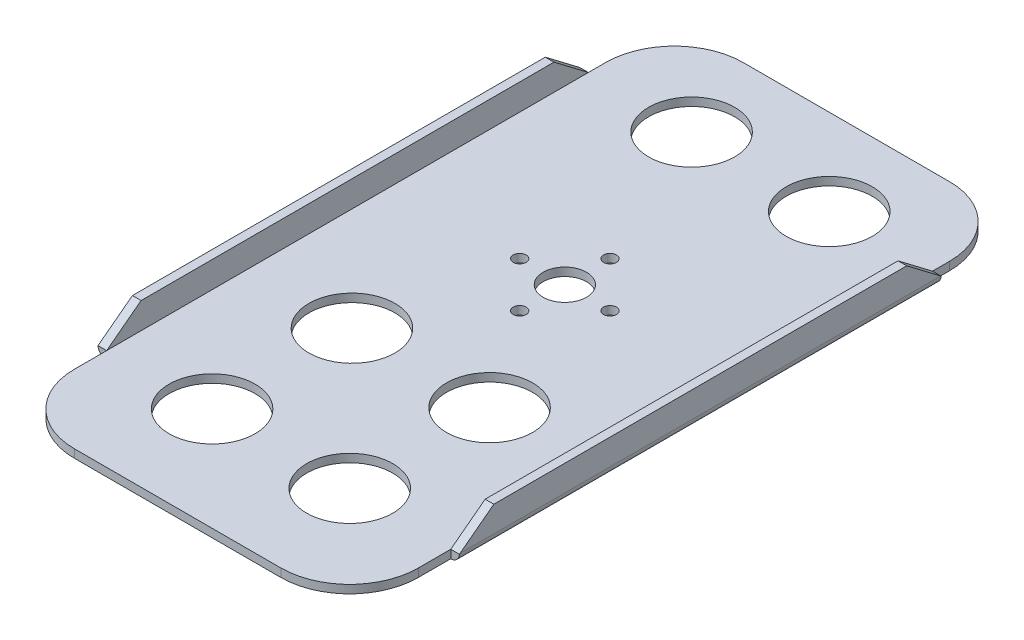
ISO-10303-21;
HEADER;
FILE_DESCRIPTION(('STEP AP214'),'2;1');
FILE_NAME('part.step','',(''),(''),'','','');
FILE_SCHEMA(('AUTOMOTIVE_DESIGN { 1 0 10303 214 1 1 1 1 }'));
ENDSEC;
DATA;
#1=APPLICATION_CONTEXT('core data for automotive mechanical design processes');
#2=APPLICATION_PROTOCOL_DEFINITION('international standard','automotive_design',2000,#1);
#3=PRODUCT_CONTEXT('',#1,'mechanical');
#4=PRODUCT('Part','Part','',(#3));
#5=PRODUCT_RELATED_PRODUCT_CATEGORY('part','',(#4));
#6=PRODUCT_DEFINITION_FORMATION('','',#4);
#7=PRODUCT_DEFINITION_CONTEXT('part definition',#1,'design');
#8=PRODUCT_DEFINITION('design','',#6,#7);
#9=PRODUCT_DEFINITION_SHAPE('','',#8);
#10=(LENGTH_UNIT() NAMED_UNIT(*) SI_UNIT(.MILLI.,.METRE.));
#11=(NAMED_UNIT(*) PLANE_ANGLE_UNIT() SI_UNIT($,.RADIAN.));
#12=(NAMED_UNIT(*) SI_UNIT($,.STERADIAN.) SOLID_ANGLE_UNIT());
#13=UNCERTAINTY_MEASURE_WITH_UNIT(LENGTH_MEASURE(1.E-05),#10,'distance_accuracy_value','');
#14=(GEOMETRIC_REPRESENTATION_CONTEXT(3) GLOBAL_UNCERTAINTY_ASSIGNED_CONTEXT((#13)) GLOBAL_UNIT_ASSIGNED_CONTEXT((#10,
#11,#12)) REPRESENTATION_CONTEXT('',''));
#15=CARTESIAN_POINT('',(0.,0.,0.));
#16=DIRECTION('',(0.,0.,1.));
#17=DIRECTION('',(1.,0.,0.));
#18=AXIS2_PLACEMENT_3D('',#15,#16,#17);
#19=CARTESIAN_POINT('',(33.3502,6.35,9.75360000000003));
#20=DIRECTION('',(1.,0.,0.));
#21=DIRECTION('',(0.,0.,-1.));
#22=AXIS2_PLACEMENT_3D('',#19,#20,#21);
#23=PLANE('',#22);
#24=DIRECTION('',(0.,0.605083267533558,-0.796162194123103));
#25=VECTOR('',#24,1.);
#26=CARTESIAN_POINT('',(33.3502,1.524,52.8066));
#27=LINE('',#26,#25);
#28=CARTESIAN_POINT('',(33.3502,1.5875,52.7230473684211));
#29=VERTEX_POINT('',#28);
#30=CARTESIAN_POINT('',(33.3502,6.35,46.4566));
#31=VERTEX_POINT('',#30);
#32=EDGE_CURVE('E398',#29,#31,#27,.T.);
#33=ORIENTED_EDGE('',*,*,#32,.F.);
#34=DIRECTION('',(0.,0.,1.));
#35=VECTOR('',#34,1.);
#36=CARTESIAN_POINT('',(33.3502,1.5875,-36.0934));
#37=LINE('',#36,#35);
#38=CARTESIAN_POINT('',(33.3502,1.5875,-36.009847368421));
#39=VERTEX_POINT('',#38);
#40=EDGE_CURVE('E49',#29,#39,#37,.F.);
#41=ORIENTED_EDGE('',*,*,#40,.T.);
#42=DIRECTION('',(0.,-0.605083267533558,-0.796162194123103));
#43=VECTOR('',#42,1.);
#44=CARTESIAN_POINT('',(33.3502,1.524,-36.0934));
#45=LINE('',#44,#43);
#46=CARTESIAN_POINT('',(33.3502,6.35,-29.7434));
#47=VERTEX_POINT('',#46);
#48=EDGE_CURVE('E188',#47,#39,#45,.T.);
#49=ORIENTED_EDGE('',*,*,#48,.F.);
#50=DIRECTION('',(0.,0.,1.));
#51=VECTOR('',#50,1.);
#52=CARTESIAN_POINT('',(33.3502,6.35,9.75360000000003));
#53=LINE('',#52,#51);
#54=EDGE_CURVE('E223',#47,#31,#53,.T.);
#55=ORIENTED_EDGE('',*,*,#54,.T.);
#56=EDGE_LOOP('',(#33,#41,#49,#55));
#57=FACE_BOUND('',#56,.T.);
#58=ADVANCED_FACE('F27',(#57),#23,.T.);
#59=CARTESIAN_POINT('',(31.75,6.35,9.75360000000001));
#60=DIRECTION('',(1.,0.,0.));
#61=DIRECTION('',(0.,0.,-1.));
#62=AXIS2_PLACEMENT_3D('',#59,#60,#61);
#63=PLANE('',#62);
#64=DIRECTION('',(0.,0.605083267533558,0.796162194123103));
#65=VECTOR('',#64,1.);
#66=CARTESIAN_POINT('',(31.75,25.3774594320487,-4.70726916835698));
#67=LINE('',#66,#65);
#68=CARTESIAN_POINT('',(31.75,1.524,-36.0934));
#69=VERTEX_POINT('',#68);
#70=CARTESIAN_POINT('',(31.75,6.35,-29.7434));
#71=VERTEX_POINT('',#70);
#72=EDGE_CURVE('E435',#69,#71,#67,.T.);
#73=ORIENTED_EDGE('',*,*,#72,.F.);
#74=DIRECTION('',(0.,0.,-1.));
#75=VECTOR('',#74,1.);
#76=CARTESIAN_POINT('',(31.75,1.524,9.75360000000001));
#77=LINE('',#76,#75);
#78=CARTESIAN_POINT('',(31.75,1.524,52.8066));
#79=VERTEX_POINT('',#78);
#80=EDGE_CURVE('E234',#79,#69,#77,.T.);
#81=ORIENTED_EDGE('',*,*,#80,.F.);
#82=DIRECTION('',(0.,-0.605083267533558,0.796162194123103));
#83=VECTOR('',#82,1.);
#84=CARTESIAN_POINT('',(31.75,24.0314655172414,23.1915137931034));
#85=LINE('',#84,#83);
#86=CARTESIAN_POINT('',(31.75,6.35,46.4566));
#87=VERTEX_POINT('',#86);
#88=EDGE_CURVE('E434',#87,#79,#85,.T.);
#89=ORIENTED_EDGE('',*,*,#88,.F.);
#90=DIRECTION('',(0.,0.,1.));
#91=VECTOR('',#90,1.);
#92=CARTESIAN_POINT('',(31.75,6.35,9.75360000000001));
#93=LINE('',#92,#91);
#94=EDGE_CURVE('E226',#71,#87,#93,.T.);
#95=ORIENTED_EDGE('',*,*,#94,.F.);
#96=EDGE_LOOP('',(#73,#81,#89,#95));
#97=FACE_BOUND('',#96,.T.);
#98=ADVANCED_FACE('F432',(#97),#63,.F.);
#99=CARTESIAN_POINT('',(-109.278287355664,6.35,9.75360000000003));
#100=DIRECTION('',(0.,1.,0.));
#101=DIRECTION('',(0.,0.,1.));
#102=AXIS2_PLACEMENT_3D('',#99,#100,#101);
#103=PLANE('',#102);
#104=ORIENTED_EDGE('',*,*,#54,.F.);
#105=DIRECTION('',(-1.,0.,0.));
#106=VECTOR('',#105,1.);
#107=CARTESIAN_POINT('',(33.3502,6.35,-29.7434));
#108=LINE('',#107,#106);
#109=EDGE_CURVE('E198',#47,#71,#108,.T.);
#110=ORIENTED_EDGE('',*,*,#109,.T.);
#111=ORIENTED_EDGE('',*,*,#94,.T.);
#112=DIRECTION('',(-1.,0.,0.));
#113=VECTOR('',#112,1.);
#114=CARTESIAN_POINT('',(33.3502,6.35,46.4566));
#115=LINE('',#114,#113);
#116=EDGE_CURVE('E404',#31,#87,#115,.T.);
#117=ORIENTED_EDGE('',*,*,#116,.F.);
#118=EDGE_LOOP('',(#104,#110,#111,#117));
#119=FACE_BOUND('',#118,.T.);
#120=ADVANCED_FACE('F510',(#119),#103,.T.);
#121=CARTESIAN_POINT('',(-31.75,6.35,9.75360000000005));
#122=DIRECTION('',(1.,0.,0.));
#123=DIRECTION('',(0.,0.,-1.));
#124=AXIS2_PLACEMENT_3D('',#121,#122,#123);
#125=PLANE('',#124);
#126=DIRECTION('',(0.,0.,-1.));
#127=VECTOR('',#126,1.);
#128=CARTESIAN_POINT('',(-31.75,1.524,9.75360000000005));
#129=LINE('',#128,#127);
#130=CARTESIAN_POINT('',(-31.75,1.524,52.8066));
#131=VERTEX_POINT('',#130);
#132=CARTESIAN_POINT('',(-31.75,1.524,-36.0934));
#133=VERTEX_POINT('',#132);
#134=EDGE_CURVE('E215',#131,#133,#129,.T.);
#135=ORIENTED_EDGE('',*,*,#134,.T.);
#136=DIRECTION('',(0.,0.605083267533558,0.796162194123103));
#137=VECTOR('',#136,1.);
#138=CARTESIAN_POINT('',(-31.75,25.3774594320487,-4.70726916835695));
#139=LINE('',#138,#137);
#140=CARTESIAN_POINT('',(-31.75,6.35,-29.7434));
#141=VERTEX_POINT('',#140);
#142=EDGE_CURVE('E462',#133,#141,#139,.T.);
#143=ORIENTED_EDGE('',*,*,#142,.T.);
#144=DIRECTION('',(0.,0.,1.));
#145=VECTOR('',#144,1.);
#146=CARTESIAN_POINT('',(-31.75,6.35,9.75360000000005));
#147=LINE('',#146,#145);
#148=CARTESIAN_POINT('',(-31.75,6.35,46.4566));
#149=VERTEX_POINT('',#148);
#150=EDGE_CURVE('E197',#141,#149,#147,.T.);
#151=ORIENTED_EDGE('',*,*,#150,.T.);
#152=DIRECTION('',(0.,-0.605083267533558,0.796162194123103));
#153=VECTOR('',#152,1.);
#154=CARTESIAN_POINT('',(-31.75,24.0314655172414,23.1915137931035));
#155=LINE('',#154,#153);
#156=EDGE_CURVE('E442',#149,#131,#155,.T.);
#157=ORIENTED_EDGE('',*,*,#156,.T.);
#158=EDGE_LOOP('',(#135,#143,#151,#157));
#159=FACE_BOUND('',#158,.T.);
#160=ADVANCED_FACE('F473',(#159),#125,.T.);
#161=CARTESIAN_POINT('',(-33.3502,6.35,9.75360000000003));
#162=DIRECTION('',(1.,0.,0.));
#163=DIRECTION('',(0.,0.,-1.));
#164=AXIS2_PLACEMENT_3D('',#161,#162,#163);
#165=PLANE('',#164);
#166=DIRECTION('',(0.,-0.605083267533558,-0.796162194123103));
#167=VECTOR('',#166,1.);
#168=CARTESIAN_POINT('',(-33.3502,1.524,-36.0934));
#169=LINE('',#168,#167);
#170=CARTESIAN_POINT('',(-33.3502,6.35,-29.7434));
#171=VERTEX_POINT('',#170);
#172=CARTESIAN_POINT('',(-33.3502,1.5875,-36.009847368421));
#173=VERTEX_POINT('',#172);
#174=EDGE_CURVE('E175',#171,#173,#169,.T.);
#175=ORIENTED_EDGE('',*,*,#174,.T.);
#176=DIRECTION('',(0.,0.,1.));
#177=VECTOR('',#176,1.);
#178=CARTESIAN_POINT('',(-33.3502,1.5875,9.75360000000003));
#179=LINE('',#178,#177);
#180=CARTESIAN_POINT('',(-33.3502,1.5875,52.7230473684211));
#181=VERTEX_POINT('',#180);
#182=EDGE_CURVE('E375',#173,#181,#179,.T.);
#183=ORIENTED_EDGE('',*,*,#182,.T.);
#184=DIRECTION('',(0.,0.605083267533558,-0.796162194123103));
#185=VECTOR('',#184,1.);
#186=CARTESIAN_POINT('',(-33.3502,1.524,52.8066));
#187=LINE('',#186,#185);
#188=CARTESIAN_POINT('',(-33.3502,6.35,46.4566));
#189=VERTEX_POINT('',#188);
#190=EDGE_CURVE('E203',#181,#189,#187,.T.);
#191=ORIENTED_EDGE('',*,*,#190,.T.);
#192=DIRECTION('',(0.,0.,1.));
#193=VECTOR('',#192,1.);
#194=CARTESIAN_POINT('',(-33.3502,6.35,9.75360000000003));
#195=LINE('',#194,#193);
#196=EDGE_CURVE('E195',#171,#189,#195,.T.);
#197=ORIENTED_EDGE('',*,*,#196,.F.);
#198=EDGE_LOOP('',(#175,#183,#191,#197));
#199=FACE_BOUND('',#198,.T.);
#200=ADVANCED_FACE('F201',(#199),#165,.F.);
#201=CARTESIAN_POINT('',(-109.278287355664,6.35,9.75360000000003));
#202=DIRECTION('',(0.,1.,0.));
#203=DIRECTION('',(0.,0.,1.));
#204=AXIS2_PLACEMENT_3D('',#201,#202,#203);
#205=PLANE('',#204);
#206=ORIENTED_EDGE('',*,*,#150,.F.);
#207=EDGE_CURVE('E180',#141,#171,#108,.T.);
#208=ORIENTED_EDGE('',*,*,#207,.T.);
#209=ORIENTED_EDGE('',*,*,#196,.T.);
#210=DIRECTION('',(1.,0.,0.));
#211=VECTOR('',#210,1.);
#212=CARTESIAN_POINT('',(-109.278287355664,6.35,46.4566));
#213=LINE('',#212,#211);
#214=EDGE_CURVE('E371',#189,#149,#213,.T.);
#215=ORIENTED_EDGE('',*,*,#214,.T.);
#216=EDGE_LOOP('',(#206,#208,#209,#215));
#217=FACE_BOUND('',#216,.T.);
#218=ADVANCED_FACE('F193',(#217),#205,.T.);
#219=CARTESIAN_POINT('',(-109.278287355664,6.35,-36.0934));
#220=DIRECTION('',(0.,0.,1.));
#221=DIRECTION('',(1.,0.,0.));
#222=AXIS2_PLACEMENT_3D('',#219,#220,#221);
#223=PLANE('',#222);
#224=DIRECTION('',(-1.,0.,0.));
#225=VECTOR('',#224,1.);
#226=CARTESIAN_POINT('',(33.3502,1.524,-36.0934));
#227=LINE('',#226,#225);
#228=CARTESIAN_POINT('',(33.3489294915932,1.524,-36.0934));
#229=VERTEX_POINT('',#228);
#230=EDGE_CURVE('E199',#229,#69,#227,.T.);
#231=ORIENTED_EDGE('',*,*,#230,.F.);
#232=CARTESIAN_POINT('',(31.7627,1.5875,-36.0934));
#233=DIRECTION('',(0.,0.,1.));
#234=DIRECTION('',(1.,0.,0.));
#235=AXIS2_PLACEMENT_3D('',#232,#233,#234);
#236=CIRCLE('',#235,1.5875);
#237=CARTESIAN_POINT('',(31.7627,0.,-36.0934));
#238=VERTEX_POINT('',#237);
#239=EDGE_CURVE('E11',#229,#238,#236,.F.);
#240=ORIENTED_EDGE('',*,*,#239,.T.);
#241=DIRECTION('',(-1.,0.,0.));
#242=VECTOR('',#241,1.);
#243=CARTESIAN_POINT('',(-109.278287355664,0.,-36.0934));
#244=LINE('',#243,#242);
#245=CARTESIAN_POINT('',(31.75,0.,-36.0934));
#246=VERTEX_POINT('',#245);
#247=EDGE_CURVE('E218',#238,#246,#244,.T.);
#248=ORIENTED_EDGE('',*,*,#247,.T.);
#249=DIRECTION('',(0.,-1.,0.));
#250=VECTOR('',#249,1.);
#251=CARTESIAN_POINT('',(31.75,6.35,-36.0934));
#252=LINE('',#251,#250);
#253=EDGE_CURVE('E231',#69,#246,#252,.T.);
#254=ORIENTED_EDGE('',*,*,#253,.F.);
#255=EDGE_LOOP('',(#231,#240,#248,#254));
#256=FACE_BOUND('',#255,.T.);
#257=ADVANCED_FACE('F411',(#256),#223,.F.);
#258=CARTESIAN_POINT('',(-109.278287355664,6.35,-36.0934));
#259=DIRECTION('',(0.,0.,-1.));
#260=DIRECTION('',(-1.,0.,0.));
#261=AXIS2_PLACEMENT_3D('',#258,#259,#260);
#262=PLANE('',#261);
#263=DIRECTION('',(1.,0.,0.));
#264=VECTOR('',#263,1.);
#265=CARTESIAN_POINT('',(-109.278287355664,0.,-36.0934));
#266=LINE('',#265,#264);
#267=CARTESIAN_POINT('',(-31.7627,0.,-36.0934));
#268=VERTEX_POINT('',#267);
#269=CARTESIAN_POINT('',(-31.75,0.,-36.0934));
#270=VERTEX_POINT('',#269);
#271=EDGE_CURVE('E445',#268,#270,#266,.T.);
#272=ORIENTED_EDGE('',*,*,#271,.F.);
#273=CARTESIAN_POINT('',(-31.7627,1.5875,-36.0934));
#274=DIRECTION('',(0.,0.,-1.));
#275=DIRECTION('',(-1.,0.,0.));
#276=AXIS2_PLACEMENT_3D('',#273,#274,#275);
#277=CIRCLE('',#276,1.5875);
#278=CARTESIAN_POINT('',(-33.3489294915932,1.524,-36.0934));
#279=VERTEX_POINT('',#278);
#280=EDGE_CURVE('E386',#268,#279,#277,.T.);
#281=ORIENTED_EDGE('',*,*,#280,.T.);
#282=DIRECTION('',(1.,0.,0.));
#283=VECTOR('',#282,1.);
#284=CARTESIAN_POINT('',(-109.278287355664,1.524,-36.0934));
#285=LINE('',#284,#283);
#286=EDGE_CURVE('E373',#279,#133,#285,.T.);
#287=ORIENTED_EDGE('',*,*,#286,.T.);
#288=DIRECTION('',(0.,-1.,0.));
#289=VECTOR('',#288,1.);
#290=CARTESIAN_POINT('',(-31.75,6.35,-36.0934));
#291=LINE('',#290,#289);
#292=EDGE_CURVE('E207',#133,#270,#291,.T.);
#293=ORIENTED_EDGE('',*,*,#292,.T.);
#294=EDGE_LOOP('',(#272,#281,#287,#293));
#295=FACE_BOUND('',#294,.T.);
#296=ADVANCED_FACE('F461',(#295),#262,.T.);
#297=CARTESIAN_POINT('',(-109.278287355664,6.35,52.8066));
#298=DIRECTION('',(0.,0.,-1.));
#299=DIRECTION('',(-1.,0.,0.));
#300=AXIS2_PLACEMENT_3D('',#297,#298,#299);
#301=PLANE('',#300);
#302=DIRECTION('',(1.,0.,0.));
#303=VECTOR('',#302,1.);
#304=CARTESIAN_POINT('',(-109.278287355664,0.,52.8066));
#305=LINE('',#304,#303);
#306=CARTESIAN_POINT('',(31.75,0.,52.8066));
#307=VERTEX_POINT('',#306);
#308=CARTESIAN_POINT('',(31.7627,0.,52.8066));
#309=VERTEX_POINT('',#308);
#310=EDGE_CURVE('E220',#307,#309,#305,.T.);
#311=ORIENTED_EDGE('',*,*,#310,.T.);
#312=CARTESIAN_POINT('',(31.7627,1.5875,52.8066));
#313=DIRECTION('',(0.,0.,-1.));
#314=DIRECTION('',(-1.,0.,0.));
#315=AXIS2_PLACEMENT_3D('',#312,#313,#314);
#316=CIRCLE('',#315,1.5875);
#317=CARTESIAN_POINT('',(33.3489294915932,1.524,52.8066));
#318=VERTEX_POINT('',#317);
#319=EDGE_CURVE('E389',#309,#318,#316,.F.);
#320=ORIENTED_EDGE('',*,*,#319,.T.);
#321=DIRECTION('',(-1.,0.,0.));
#322=VECTOR('',#321,1.);
#323=CARTESIAN_POINT('',(33.3502,1.524,52.8066));
#324=LINE('',#323,#322);
#325=EDGE_CURVE('E400',#318,#79,#324,.T.);
#326=ORIENTED_EDGE('',*,*,#325,.T.);
#327=DIRECTION('',(0.,-1.,0.));
#328=VECTOR('',#327,1.);
#329=CARTESIAN_POINT('',(31.75,6.35,52.8066));
#330=LINE('',#329,#328);
#331=EDGE_CURVE('E228',#79,#307,#330,.T.);
#332=ORIENTED_EDGE('',*,*,#331,.T.);
#333=EDGE_LOOP('',(#311,#320,#326,#332));
#334=FACE_BOUND('',#333,.T.);
#335=ADVANCED_FACE('F441',(#334),#301,.F.);
#336=CARTESIAN_POINT('',(-109.278287355664,6.35,52.8066));
#337=DIRECTION('',(0.,0.,1.));
#338=DIRECTION('',(1.,0.,0.));
#339=AXIS2_PLACEMENT_3D('',#336,#337,#338);
#340=PLANE('',#339);
#341=CARTESIAN_POINT('',(-33.3489294915932,1.524,52.8066));
#342=VERTEX_POINT('',#341);
#343=EDGE_CURVE('E443',#131,#342,#324,.T.);
#344=ORIENTED_EDGE('',*,*,#343,.T.);
#345=CARTESIAN_POINT('',(-31.7627,1.5875,52.8066));
#346=DIRECTION('',(0.,0.,1.));
#347=DIRECTION('',(1.,0.,0.));
#348=AXIS2_PLACEMENT_3D('',#345,#346,#347);
#349=CIRCLE('',#348,1.5875);
#350=CARTESIAN_POINT('',(-31.7627,0.,52.8066));
#351=VERTEX_POINT('',#350);
#352=EDGE_CURVE('E379',#342,#351,#349,.T.);
#353=ORIENTED_EDGE('',*,*,#352,.T.);
#354=DIRECTION('',(-1.,0.,0.));
#355=VECTOR('',#354,1.);
#356=CARTESIAN_POINT('',(-109.278287355664,0.,52.8066));
#357=LINE('',#356,#355);
#358=CARTESIAN_POINT('',(-31.75,0.,52.8066));
#359=VERTEX_POINT('',#358);
#360=EDGE_CURVE('E209',#359,#351,#357,.T.);
#361=ORIENTED_EDGE('',*,*,#360,.F.);
#362=DIRECTION('',(0.,-1.,0.));
#363=VECTOR('',#362,1.);
#364=CARTESIAN_POINT('',(-31.75,6.35,52.8066));
#365=LINE('',#364,#363);
#366=EDGE_CURVE('E204',#131,#359,#365,.T.);
#367=ORIENTED_EDGE('',*,*,#366,.F.);
#368=EDGE_LOOP('',(#344,#353,#361,#367));
#369=FACE_BOUND('',#368,.T.);
#370=ADVANCED_FACE('F532',(#369),#340,.T.);
#371=CARTESIAN_POINT('',(-31.75,1.524,9.75360000000005));
#372=DIRECTION('',(1.,0.,0.));
#373=DIRECTION('',(0.,0.,-1.));
#374=AXIS2_PLACEMENT_3D('',#371,#372,#373);
#375=PLANE('',#374);
#376=DIRECTION('',(0.,0.,1.));
#377=VECTOR('',#376,1.);
#378=CARTESIAN_POINT('',(-31.75,0.,9.75360000000005));
#379=LINE('',#378,#377);
#380=CARTESIAN_POINT('',(-31.75,0.,-39.2684));
#381=VERTEX_POINT('',#380);
#382=EDGE_CURVE('E271',#381,#270,#379,.T.);
#383=ORIENTED_EDGE('',*,*,#382,.T.);
#384=ORIENTED_EDGE('',*,*,#292,.F.);
#385=DIRECTION('',(0.,0.,1.));
#386=VECTOR('',#385,1.);
#387=CARTESIAN_POINT('',(-31.75,1.524,9.75360000000005));
#388=LINE('',#387,#386);
#389=CARTESIAN_POINT('',(-31.75,1.524,-39.2684));
#390=VERTEX_POINT('',#389);
#391=EDGE_CURVE('E330',#390,#133,#388,.T.);
#392=ORIENTED_EDGE('',*,*,#391,.F.);
#393=DIRECTION('',(0.,-1.,0.));
#394=VECTOR('',#393,1.);
#395=CARTESIAN_POINT('',(-31.75,1.524,-39.2684));
#396=LINE('',#395,#394);
#397=EDGE_CURVE('E353',#390,#381,#396,.T.);
#398=ORIENTED_EDGE('',*,*,#397,.T.);
#399=EDGE_LOOP('',(#383,#384,#392,#398));
#400=FACE_BOUND('',#399,.T.);
#401=ADVANCED_FACE('F468',(#400),#375,.F.);
#402=CARTESIAN_POINT('',(31.75,1.524,9.75359999999999));
#403=DIRECTION('',(1.,0.,0.));
#404=DIRECTION('',(0.,0.,-1.));
#405=AXIS2_PLACEMENT_3D('',#402,#403,#404);
#406=PLANE('',#405);
#407=DIRECTION('',(0.,0.,1.));
#408=VECTOR('',#407,1.);
#409=CARTESIAN_POINT('',(31.75,1.524,9.75359999999999));
#410=LINE('',#409,#408);
#411=CARTESIAN_POINT('',(31.75,1.524,-39.2684));
#412=VERTEX_POINT('',#411);
#413=EDGE_CURVE('E342',#412,#69,#410,.T.);
#414=ORIENTED_EDGE('',*,*,#413,.T.);
#415=ORIENTED_EDGE('',*,*,#253,.T.);
#416=DIRECTION('',(0.,0.,1.));
#417=VECTOR('',#416,1.);
#418=CARTESIAN_POINT('',(31.75,0.,9.75359999999999));
#419=LINE('',#418,#417);
#420=CARTESIAN_POINT('',(31.75,0.,-39.2684));
#421=VERTEX_POINT('',#420);
#422=EDGE_CURVE('E284',#421,#246,#419,.T.);
#423=ORIENTED_EDGE('',*,*,#422,.F.);
#424=DIRECTION('',(0.,-1.,0.));
#425=VECTOR('',#424,1.);
#426=CARTESIAN_POINT('',(31.75,1.524,-39.2684));
#427=LINE('',#426,#425);
#428=EDGE_CURVE('E359',#412,#421,#427,.T.);
#429=ORIENTED_EDGE('',*,*,#428,.F.);
#430=EDGE_LOOP('',(#414,#415,#423,#429));
#431=FACE_BOUND('',#430,.T.);
#432=ADVANCED_FACE('F419',(#431),#406,.T.);
#433=CARTESIAN_POINT('',(31.75,0.,58.7756));
#434=VERTEX_POINT('',#433);
#435=EDGE_CURVE('E283',#307,#434,#419,.T.);
#436=ORIENTED_EDGE('',*,*,#435,.F.);
#437=ORIENTED_EDGE('',*,*,#331,.F.);
#438=CARTESIAN_POINT('',(31.75,1.524,58.7756));
#439=VERTEX_POINT('',#438);
#440=EDGE_CURVE('E341',#79,#439,#410,.T.);
#441=ORIENTED_EDGE('',*,*,#440,.T.);
#442=DIRECTION('',(0.,-1.,0.));
#443=VECTOR('',#442,1.);
#444=CARTESIAN_POINT('',(31.75,1.524,58.7756));
#445=LINE('',#444,#443);
#446=EDGE_CURVE('E361',#439,#434,#445,.T.);
#447=ORIENTED_EDGE('',*,*,#446,.T.);
#448=EDGE_LOOP('',(#436,#437,#441,#447));
#449=FACE_BOUND('',#448,.T.);
#450=ADVANCED_FACE('F438',(#449),#406,.T.);
#451=CARTESIAN_POINT('',(-31.75,1.524,58.7756));
#452=VERTEX_POINT('',#451);
#453=EDGE_CURVE('E329',#131,#452,#388,.T.);
#454=ORIENTED_EDGE('',*,*,#453,.F.);
#455=ORIENTED_EDGE('',*,*,#366,.T.);
#456=CARTESIAN_POINT('',(-31.75,0.,58.7756));
#457=VERTEX_POINT('',#456);
#458=EDGE_CURVE('E270',#359,#457,#379,.T.);
#459=ORIENTED_EDGE('',*,*,#458,.T.);
#460=DIRECTION('',(0.,-1.,0.));
#461=VECTOR('',#460,1.);
#462=CARTESIAN_POINT('',(-31.75,1.524,58.7756));
#463=LINE('',#462,#461);
#464=EDGE_CURVE('E368',#452,#457,#463,.T.);
#465=ORIENTED_EDGE('',*,*,#464,.F.);
#466=EDGE_LOOP('',(#454,#455,#459,#465));
#467=FACE_BOUND('',#466,.T.);
#468=ADVANCED_FACE('F479',(#467),#375,.F.);
#469=CARTESIAN_POINT('',(-19.05,1.524,58.7756));
#470=DIRECTION('',(0.,-1.,0.));
#471=DIRECTION('',(0.,0.,-1.));
#472=AXIS2_PLACEMENT_3D('',#469,#470,#471);
#473=CYLINDRICAL_SURFACE('',#472,12.7);
#474=CARTESIAN_POINT('',(-19.05,0.,58.7756));
#475=DIRECTION('',(0.,1.,0.));
#476=DIRECTION('',(0.,0.,1.));
#477=AXIS2_PLACEMENT_3D('',#474,#475,#476);
#478=CIRCLE('',#477,12.7);
#479=CARTESIAN_POINT('',(-19.05,0.,71.4756));
#480=VERTEX_POINT('',#479);
#481=EDGE_CURVE('E274',#457,#480,#478,.T.);
#482=ORIENTED_EDGE('',*,*,#481,.T.);
#483=DIRECTION('',(0.,-1.,0.));
#484=VECTOR('',#483,1.);
#485=CARTESIAN_POINT('',(-19.05,1.524,71.4756));
#486=LINE('',#485,#484);
#487=CARTESIAN_POINT('',(-19.05,1.524,71.4756));
#488=VERTEX_POINT('',#487);
#489=EDGE_CURVE('E366',#488,#480,#486,.T.);
#490=ORIENTED_EDGE('',*,*,#489,.F.);
#491=CARTESIAN_POINT('',(-19.05,1.524,58.7756));
#492=DIRECTION('',(0.,1.,0.));
#493=DIRECTION('',(0.,0.,1.));
#494=AXIS2_PLACEMENT_3D('',#491,#492,#493);
#495=CIRCLE('',#494,12.7);
#496=EDGE_CURVE('E333',#452,#488,#495,.T.);
#497=ORIENTED_EDGE('',*,*,#496,.F.);
#498=ORIENTED_EDGE('',*,*,#464,.T.);
#499=EDGE_LOOP('',(#482,#490,#497,#498));
#500=FACE_BOUND('',#499,.T.);
#501=ADVANCED_FACE('F484',(#500),#473,.T.);
#502=CARTESIAN_POINT('',(-109.278287355664,1.524,71.4756));
#503=DIRECTION('',(0.,0.,1.));
#504=DIRECTION('',(1.,0.,0.));
#505=AXIS2_PLACEMENT_3D('',#502,#503,#504);
#506=PLANE('',#505);
#507=DIRECTION('',(-1.,0.,0.));
#508=VECTOR('',#507,1.);
#509=CARTESIAN_POINT('',(-109.278287355664,0.,71.4756));
#510=LINE('',#509,#508);
#511=CARTESIAN_POINT('',(19.05,0.,71.4756));
#512=VERTEX_POINT('',#511);
#513=EDGE_CURVE('E277',#512,#480,#510,.T.);
#514=ORIENTED_EDGE('',*,*,#513,.F.);
#515=DIRECTION('',(0.,-1.,0.));
#516=VECTOR('',#515,1.);
#517=CARTESIAN_POINT('',(19.05,1.524,71.4756));
#518=LINE('',#517,#516);
#519=CARTESIAN_POINT('',(19.05,1.524,71.4756));
#520=VERTEX_POINT('',#519);
#521=EDGE_CURVE('E364',#520,#512,#518,.T.);
#522=ORIENTED_EDGE('',*,*,#521,.F.);
#523=DIRECTION('',(-1.,0.,0.));
#524=VECTOR('',#523,1.);
#525=CARTESIAN_POINT('',(-109.278287355664,1.524,71.4756));
#526=LINE('',#525,#524);
#527=EDGE_CURVE('E335',#520,#488,#526,.T.);
#528=ORIENTED_EDGE('',*,*,#527,.T.);
#529=ORIENTED_EDGE('',*,*,#489,.T.);
#530=EDGE_LOOP('',(#514,#522,#528,#529));
#531=FACE_BOUND('',#530,.T.);
#532=ADVANCED_FACE('F487',(#531),#506,.T.);
#533=CARTESIAN_POINT('',(19.05,1.524,58.7756));
#534=DIRECTION('',(0.,-1.,0.));
#535=DIRECTION('',(0.,0.,-1.));
#536=AXIS2_PLACEMENT_3D('',#533,#534,#535);
#537=CYLINDRICAL_SURFACE('',#536,12.7);
#538=CARTESIAN_POINT('',(19.05,0.,58.7756));
#539=DIRECTION('',(0.,1.,0.));
#540=DIRECTION('',(0.,0.,1.));
#541=AXIS2_PLACEMENT_3D('',#538,#539,#540);
#542=CIRCLE('',#541,12.7);
#543=EDGE_CURVE('E280',#434,#512,#542,.F.);
#544=ORIENTED_EDGE('',*,*,#543,.F.);
#545=ORIENTED_EDGE('',*,*,#446,.F.);
#546=CARTESIAN_POINT('',(19.05,1.524,58.7756));
#547=DIRECTION('',(0.,1.,0.));
#548=DIRECTION('',(0.,0.,1.));
#549=AXIS2_PLACEMENT_3D('',#546,#547,#548);
#550=CIRCLE('',#549,12.7);
#551=EDGE_CURVE('E338',#439,#520,#550,.F.);
#552=ORIENTED_EDGE('',*,*,#551,.T.);
#553=ORIENTED_EDGE('',*,*,#521,.T.);
#554=EDGE_LOOP('',(#544,#545,#552,#553));
#555=FACE_BOUND('',#554,.T.);
#556=ADVANCED_FACE('F490',(#555),#537,.T.);
#557=CARTESIAN_POINT('',(19.05,1.524,-39.2684));
#558=DIRECTION('',(0.,-1.,0.));
#559=DIRECTION('',(0.,0.,-1.));
#560=AXIS2_PLACEMENT_3D('',#557,#558,#559);
#561=CYLINDRICAL_SURFACE('',#560,12.7);
#562=CARTESIAN_POINT('',(19.05,0.,-39.2684));
#563=DIRECTION('',(0.,1.,0.));
#564=DIRECTION('',(0.,0.,1.));
#565=AXIS2_PLACEMENT_3D('',#562,#563,#564);
#566=CIRCLE('',#565,12.7);
#567=CARTESIAN_POINT('',(19.05,0.,-51.9684));
#568=VERTEX_POINT('',#567);
#569=EDGE_CURVE('E287',#421,#568,#566,.T.);
#570=ORIENTED_EDGE('',*,*,#569,.T.);
#571=DIRECTION('',(0.,-1.,0.));
#572=VECTOR('',#571,1.);
#573=CARTESIAN_POINT('',(19.05,1.524,-51.9684));
#574=LINE('',#573,#572);
#575=CARTESIAN_POINT('',(19.05,1.524,-51.9684));
#576=VERTEX_POINT('',#575);
#577=EDGE_CURVE('E357',#576,#568,#574,.T.);
#578=ORIENTED_EDGE('',*,*,#577,.F.);
#579=CARTESIAN_POINT('',(19.05,1.524,-39.2684));
#580=DIRECTION('',(0.,1.,0.));
#581=DIRECTION('',(0.,0.,1.));
#582=AXIS2_PLACEMENT_3D('',#579,#580,#581);
#583=CIRCLE('',#582,12.7);
#584=EDGE_CURVE('E345',#412,#576,#583,.T.);
#585=ORIENTED_EDGE('',*,*,#584,.F.);
#586=ORIENTED_EDGE('',*,*,#428,.T.);
#587=EDGE_LOOP('',(#570,#578,#585,#586));
#588=FACE_BOUND('',#587,.T.);
#589=ADVANCED_FACE('F492',(#588),#561,.T.);
#590=CARTESIAN_POINT('',(-109.278287355664,1.524,-51.9684));
#591=DIRECTION('',(0.,0.,-1.));
#592=DIRECTION('',(-1.,0.,0.));
#593=AXIS2_PLACEMENT_3D('',#590,#591,#592);
#594=PLANE('',#593);
#595=DIRECTION('',(1.,0.,0.));
#596=VECTOR('',#595,1.);
#597=CARTESIAN_POINT('',(-109.278287355664,0.,-51.9684));
#598=LINE('',#597,#596);
#599=CARTESIAN_POINT('',(-19.05,0.,-51.9684));
#600=VERTEX_POINT('',#599);
#601=EDGE_CURVE('E290',#600,#568,#598,.T.);
#602=ORIENTED_EDGE('',*,*,#601,.F.);
#603=DIRECTION('',(0.,-1.,0.));
#604=VECTOR('',#603,1.);
#605=CARTESIAN_POINT('',(-19.05,1.524,-51.9684));
#606=LINE('',#605,#604);
#607=CARTESIAN_POINT('',(-19.05,1.524,-51.9684));
#608=VERTEX_POINT('',#607);
#609=EDGE_CURVE('E355',#608,#600,#606,.T.);
#610=ORIENTED_EDGE('',*,*,#609,.F.);
#611=DIRECTION('',(1.,0.,0.));
#612=VECTOR('',#611,1.);
#613=CARTESIAN_POINT('',(-109.278287355664,1.524,-51.9684));
#614=LINE('',#613,#612);
#615=EDGE_CURVE('E347',#608,#576,#614,.T.);
#616=ORIENTED_EDGE('',*,*,#615,.T.);
#617=ORIENTED_EDGE('',*,*,#577,.T.);
#618=EDGE_LOOP('',(#602,#610,#616,#617));
#619=FACE_BOUND('',#618,.T.);
#620=ADVANCED_FACE('F498',(#619),#594,.T.);
#621=CARTESIAN_POINT('',(-12.7,1.524,26.5938));
#622=DIRECTION('',(0.,-1.,0.));
#623=DIRECTION('',(0.,0.,-1.));
#624=AXIS2_PLACEMENT_3D('',#621,#622,#623);
#625=CYLINDRICAL_SURFACE('',#624,7.9375);
#626=CARTESIAN_POINT('',(-12.7,1.524,26.5938));
#627=DIRECTION('',(0.,1.,0.));
#628=DIRECTION('',(0.,0.,1.));
#629=AXIS2_PLACEMENT_3D('',#626,#627,#628);
#630=CIRCLE('',#629,7.9375);
#631=CARTESIAN_POINT('',(-12.7,1.524,34.5313));
#632=VERTEX_POINT('',#631);
#633=EDGE_CURVE('E326',#632,#632,#630,.F.);
#634=ORIENTED_EDGE('',*,*,#633,.F.);
#635=EDGE_LOOP('',(#634));
#636=FACE_BOUND('',#635,.T.);
#637=CARTESIAN_POINT('',(-12.7,0.,26.5938));
#638=DIRECTION('',(0.,1.,0.));
#639=DIRECTION('',(0.,0.,1.));
#640=AXIS2_PLACEMENT_3D('',#637,#638,#639);
#641=CIRCLE('',#640,7.9375);
#642=CARTESIAN_POINT('',(-12.7,0.,34.5313));
#643=VERTEX_POINT('',#642);
#644=EDGE_CURVE('E267',#643,#643,#641,.F.);
#645=ORIENTED_EDGE('',*,*,#644,.T.);
#646=EDGE_LOOP('',(#645));
#647=FACE_BOUND('',#646,.T.);
#648=ADVANCED_FACE('F525',(#636,#647),#625,.F.);
#649=CARTESIAN_POINT('',(-8.3312,1.524,0.));
#650=DIRECTION('',(0.,-1.,0.));
#651=DIRECTION('',(0.,0.,-1.));
#652=AXIS2_PLACEMENT_3D('',#649,#650,#651);
#653=CYLINDRICAL_SURFACE('',#652,1.1938);
#654=CARTESIAN_POINT('',(-8.3312,1.524,0.));
#655=DIRECTION('',(0.,1.,0.));
#656=DIRECTION('',(0.,0.,1.));
#657=AXIS2_PLACEMENT_3D('',#654,#655,#656);
#658=CIRCLE('',#657,1.1938);
#659=CARTESIAN_POINT('',(-8.3312,1.524,1.1938));
#660=VERTEX_POINT('',#659);
#661=EDGE_CURVE('E323',#660,#660,#658,.F.);
#662=ORIENTED_EDGE('',*,*,#661,.F.);
#663=EDGE_LOOP('',(#662));
#664=FACE_BOUND('',#663,.T.);
#665=CARTESIAN_POINT('',(-8.3312,0.,0.));
#666=DIRECTION('',(0.,1.,0.));
#667=DIRECTION('',(0.,0.,1.));
#668=AXIS2_PLACEMENT_3D('',#665,#666,#667);
#669=CIRCLE('',#668,1.1938);
#670=CARTESIAN_POINT('',(-8.3312,0.,1.1938));
#671=VERTEX_POINT('',#670);
#672=EDGE_CURVE('E264',#671,#671,#669,.F.);
#673=ORIENTED_EDGE('',*,*,#672,.T.);
#674=EDGE_LOOP('',(#673));
#675=FACE_BOUND('',#674,.T.);
#676=ADVANCED_FACE('F575',(#664,#675),#653,.F.);
#677=CARTESIAN_POINT('',(0.,1.524,-8.3312));
#678=DIRECTION('',(0.,-1.,0.));
#679=DIRECTION('',(0.,0.,-1.));
#680=AXIS2_PLACEMENT_3D('',#677,#678,#679);
#681=CYLINDRICAL_SURFACE('',#680,1.1938);
#682=CARTESIAN_POINT('',(0.,1.524,-8.3312));
#683=DIRECTION('',(0.,1.,0.));
#684=DIRECTION('',(0.,0.,1.));
#685=AXIS2_PLACEMENT_3D('',#682,#683,#684);
#686=CIRCLE('',#685,1.1938);
#687=CARTESIAN_POINT('',(0.,1.524,-7.1374));
#688=VERTEX_POINT('',#687);
#689=EDGE_CURVE('E320',#688,#688,#686,.T.);
#690=ORIENTED_EDGE('',*,*,#689,.T.);
#691=EDGE_LOOP('',(#690));
#692=FACE_BOUND('',#691,.T.);
#693=CARTESIAN_POINT('',(0.,0.,-8.3312));
#694=DIRECTION('',(0.,1.,0.));
#695=DIRECTION('',(0.,0.,1.));
#696=AXIS2_PLACEMENT_3D('',#693,#694,#695);
#697=CIRCLE('',#696,1.1938);
#698=CARTESIAN_POINT('',(0.,0.,-7.1374));
#699=VERTEX_POINT('',#698);
#700=EDGE_CURVE('E261',#699,#699,#697,.T.);
#701=ORIENTED_EDGE('',*,*,#700,.F.);
#702=EDGE_LOOP('',(#701));
#703=FACE_BOUND('',#702,.T.);
#704=ADVANCED_FACE('F582',(#692,#703),#681,.F.);
#705=CARTESIAN_POINT('',(0.,1.524,8.3312));
#706=DIRECTION('',(0.,-1.,0.));
#707=DIRECTION('',(0.,0.,-1.));
#708=AXIS2_PLACEMENT_3D('',#705,#706,#707);
#709=CYLINDRICAL_SURFACE('',#708,1.1938);
#710=CARTESIAN_POINT('',(0.,1.524,8.3312));
#711=DIRECTION('',(0.,1.,0.));
#712=DIRECTION('',(0.,0.,1.));
#713=AXIS2_PLACEMENT_3D('',#710,#711,#712);
#714=CIRCLE('',#713,1.1938);
#715=CARTESIAN_POINT('',(0.,1.524,9.525));
#716=VERTEX_POINT('',#715);
#717=EDGE_CURVE('E317',#716,#716,#714,.T.);
#718=ORIENTED_EDGE('',*,*,#717,.T.);
#719=EDGE_LOOP('',(#718));
#720=FACE_BOUND('',#719,.T.);
#721=CARTESIAN_POINT('',(0.,0.,8.3312));
#722=DIRECTION('',(0.,1.,0.));
#723=DIRECTION('',(0.,0.,1.));
#724=AXIS2_PLACEMENT_3D('',#721,#722,#723);
#725=CIRCLE('',#724,1.1938);
#726=CARTESIAN_POINT('',(0.,0.,9.525));
#727=VERTEX_POINT('',#726);
#728=EDGE_CURVE('E258',#727,#727,#725,.T.);
#729=ORIENTED_EDGE('',*,*,#728,.F.);
#730=EDGE_LOOP('',(#729));
#731=FACE_BOUND('',#730,.T.);
#732=ADVANCED_FACE('F590',(#720,#731),#709,.F.);
#733=CARTESIAN_POINT('',(8.3312,1.524,0.));
#734=DIRECTION('',(0.,-1.,0.));
#735=DIRECTION('',(0.,0.,-1.));
#736=AXIS2_PLACEMENT_3D('',#733,#734,#735);
#737=CYLINDRICAL_SURFACE('',#736,1.1938);
#738=CARTESIAN_POINT('',(8.3312,1.524,0.));
#739=DIRECTION('',(0.,1.,0.));
#740=DIRECTION('',(0.,0.,1.));
#741=AXIS2_PLACEMENT_3D('',#738,#739,#740);
#742=CIRCLE('',#741,1.1938);
#743=CARTESIAN_POINT('',(8.3312,1.524,1.1938));
#744=VERTEX_POINT('',#743);
#745=EDGE_CURVE('E314',#744,#744,#742,.T.);
#746=ORIENTED_EDGE('',*,*,#745,.T.);
#747=EDGE_LOOP('',(#746));
#748=FACE_BOUND('',#747,.T.);
#749=CARTESIAN_POINT('',(8.3312,0.,0.));
#750=DIRECTION('',(0.,1.,0.));
#751=DIRECTION('',(0.,0.,1.));
#752=AXIS2_PLACEMENT_3D('',#749,#750,#751);
#753=CIRCLE('',#752,1.1938);
#754=CARTESIAN_POINT('',(8.3312,0.,1.1938));
#755=VERTEX_POINT('',#754);
#756=EDGE_CURVE('E255',#755,#755,#753,.T.);
#757=ORIENTED_EDGE('',*,*,#756,.F.);
#758=EDGE_LOOP('',(#757));
#759=FACE_BOUND('',#758,.T.);
#760=ADVANCED_FACE('F598',(#748,#759),#737,.F.);
#761=CARTESIAN_POINT('',(0.,1.524,0.));
#762=DIRECTION('',(0.,-1.,0.));
#763=DIRECTION('',(0.,0.,-1.));
#764=AXIS2_PLACEMENT_3D('',#761,#762,#763);
#765=CYLINDRICAL_SURFACE('',#764,4.0005);
#766=CARTESIAN_POINT('',(0.,1.524,0.));
#767=DIRECTION('',(0.,1.,0.));
#768=DIRECTION('',(0.,0.,1.));
#769=AXIS2_PLACEMENT_3D('',#766,#767,#768);
#770=CIRCLE('',#769,4.0005);
#771=CARTESIAN_POINT('',(0.,1.524,4.0005));
#772=VERTEX_POINT('',#771);
#773=EDGE_CURVE('E311',#772,#772,#770,.T.);
#774=ORIENTED_EDGE('',*,*,#773,.T.);
#775=EDGE_LOOP('',(#774));
#776=FACE_BOUND('',#775,.T.);
#777=CARTESIAN_POINT('',(0.,0.,0.));
#778=DIRECTION('',(0.,1.,0.));
#779=DIRECTION('',(0.,0.,1.));
#780=AXIS2_PLACEMENT_3D('',#777,#778,#779);
#781=CIRCLE('',#780,4.0005);
#782=CARTESIAN_POINT('',(0.,0.,4.0005));
#783=VERTEX_POINT('',#782);
#784=EDGE_CURVE('E252',#783,#783,#781,.T.);
#785=ORIENTED_EDGE('',*,*,#784,.F.);
#786=EDGE_LOOP('',(#785));
#787=FACE_BOUND('',#786,.T.);
#788=ADVANCED_FACE('F606',(#776,#787),#765,.F.);
#789=CARTESIAN_POINT('',(12.7,1.524,-36.0934));
#790=DIRECTION('',(0.,-1.,0.));
#791=DIRECTION('',(0.,0.,-1.));
#792=AXIS2_PLACEMENT_3D('',#789,#790,#791);
#793=CYLINDRICAL_SURFACE('',#792,7.9375);
#794=CARTESIAN_POINT('',(12.7,1.524,-36.0934));
#795=DIRECTION('',(0.,1.,0.));
#796=DIRECTION('',(0.,0.,1.));
#797=AXIS2_PLACEMENT_3D('',#794,#795,#796);
#798=CIRCLE('',#797,7.9375);
#799=CARTESIAN_POINT('',(12.7,1.524,-28.1559));
#800=VERTEX_POINT('',#799);
#801=EDGE_CURVE('E308',#800,#800,#798,.T.);
#802=ORIENTED_EDGE('',*,*,#801,.T.);
#803=EDGE_LOOP('',(#802));
#804=FACE_BOUND('',#803,.T.);
#805=CARTESIAN_POINT('',(12.7,0.,-36.0934));
#806=DIRECTION('',(0.,1.,0.));
#807=DIRECTION('',(0.,0.,1.));
#808=AXIS2_PLACEMENT_3D('',#805,#806,#807);
#809=CIRCLE('',#808,7.9375);
#810=CARTESIAN_POINT('',(12.7,0.,-28.1559));
#811=VERTEX_POINT('',#810);
#812=EDGE_CURVE('E249',#811,#811,#809,.T.);
#813=ORIENTED_EDGE('',*,*,#812,.F.);
#814=EDGE_LOOP('',(#813));
#815=FACE_BOUND('',#814,.T.);
#816=ADVANCED_FACE('F614',(#804,#815),#793,.F.);
#817=CARTESIAN_POINT('',(12.7,1.524,26.5938));
#818=DIRECTION('',(0.,-1.,0.));
#819=DIRECTION('',(0.,0.,-1.));
#820=AXIS2_PLACEMENT_3D('',#817,#818,#819);
#821=CYLINDRICAL_SURFACE('',#820,7.9375);
#822=CARTESIAN_POINT('',(12.7,1.524,26.5938));
#823=DIRECTION('',(0.,1.,0.));
#824=DIRECTION('',(0.,0.,1.));
#825=AXIS2_PLACEMENT_3D('',#822,#823,#824);
#826=CIRCLE('',#825,7.9375);
#827=CARTESIAN_POINT('',(12.7,1.524,34.5313));
#828=VERTEX_POINT('',#827);
#829=EDGE_CURVE('E305',#828,#828,#826,.T.);
#830=ORIENTED_EDGE('',*,*,#829,.T.);
#831=EDGE_LOOP('',(#830));
#832=FACE_BOUND('',#831,.T.);
#833=CARTESIAN_POINT('',(12.7,0.,26.5938));
#834=DIRECTION('',(0.,1.,0.));
#835=DIRECTION('',(0.,0.,1.));
#836=AXIS2_PLACEMENT_3D('',#833,#834,#835);
#837=CIRCLE('',#836,7.9375);
#838=CARTESIAN_POINT('',(12.7,0.,34.5313));
#839=VERTEX_POINT('',#838);
#840=EDGE_CURVE('E246',#839,#839,#837,.T.);
#841=ORIENTED_EDGE('',*,*,#840,.F.);
#842=EDGE_LOOP('',(#841));
#843=FACE_BOUND('',#842,.T.);
#844=ADVANCED_FACE('F622',(#832,#843),#821,.F.);
#845=CARTESIAN_POINT('',(12.7,1.524,52.4002));
#846=DIRECTION('',(0.,-1.,0.));
#847=DIRECTION('',(0.,0.,-1.));
#848=AXIS2_PLACEMENT_3D('',#845,#846,#847);
#849=CYLINDRICAL_SURFACE('',#848,7.9375);
#850=CARTESIAN_POINT('',(12.7,1.524,52.4002));
#851=DIRECTION('',(0.,1.,0.));
#852=DIRECTION('',(0.,0.,1.));
#853=AXIS2_PLACEMENT_3D('',#850,#851,#852);
#854=CIRCLE('',#853,7.9375);
#855=CARTESIAN_POINT('',(12.7,1.524,60.3377));
#856=VERTEX_POINT('',#855);
#857=EDGE_CURVE('E302',#856,#856,#854,.T.);
#858=ORIENTED_EDGE('',*,*,#857,.T.);
#859=EDGE_LOOP('',(#858));
#860=FACE_BOUND('',#859,.T.);
#861=CARTESIAN_POINT('',(12.7,0.,52.4002));
#862=DIRECTION('',(0.,1.,0.));
#863=DIRECTION('',(0.,0.,1.));
#864=AXIS2_PLACEMENT_3D('',#861,#862,#863);
#865=CIRCLE('',#864,7.9375);
#866=CARTESIAN_POINT('',(12.7,0.,60.3377));
#867=VERTEX_POINT('',#866);
#868=EDGE_CURVE('E243',#867,#867,#865,.T.);
#869=ORIENTED_EDGE('',*,*,#868,.F.);
#870=EDGE_LOOP('',(#869));
#871=FACE_BOUND('',#870,.T.);
#872=ADVANCED_FACE('F630',(#860,#871),#849,.F.);
#873=CARTESIAN_POINT('',(-12.7,1.524,-36.0934));
#874=DIRECTION('',(0.,-1.,0.));
#875=DIRECTION('',(0.,0.,-1.));
#876=AXIS2_PLACEMENT_3D('',#873,#874,#875);
#877=CYLINDRICAL_SURFACE('',#876,7.9375);
#878=CARTESIAN_POINT('',(-12.7,1.524,-36.0934));
#879=DIRECTION('',(0.,1.,0.));
#880=DIRECTION('',(0.,0.,1.));
#881=AXIS2_PLACEMENT_3D('',#878,#879,#880);
#882=CIRCLE('',#881,7.9375);
#883=CARTESIAN_POINT('',(-12.7,1.524,-28.1559));
#884=VERTEX_POINT('',#883);
#885=EDGE_CURVE('E299',#884,#884,#882,.F.);
#886=ORIENTED_EDGE('',*,*,#885,.F.);
#887=EDGE_LOOP('',(#886));
#888=FACE_BOUND('',#887,.T.);
#889=CARTESIAN_POINT('',(-12.7,0.,-36.0934));
#890=DIRECTION('',(0.,1.,0.));
#891=DIRECTION('',(0.,0.,1.));
#892=AXIS2_PLACEMENT_3D('',#889,#890,#891);
#893=CIRCLE('',#892,7.9375);
#894=CARTESIAN_POINT('',(-12.7,0.,-28.1559));
#895=VERTEX_POINT('',#894);
#896=EDGE_CURVE('E240',#895,#895,#893,.F.);
#897=ORIENTED_EDGE('',*,*,#896,.T.);
#898=EDGE_LOOP('',(#897));
#899=FACE_BOUND('',#898,.T.);
#900=ADVANCED_FACE('F637',(#888,#899),#877,.F.);
#901=CARTESIAN_POINT('',(-12.7,1.524,52.4002));
#902=DIRECTION('',(0.,-1.,0.));
#903=DIRECTION('',(0.,0.,-1.));
#904=AXIS2_PLACEMENT_3D('',#901,#902,#903);
#905=CYLINDRICAL_SURFACE('',#904,7.9375);
#906=CARTESIAN_POINT('',(-12.7,1.524,52.4002));
#907=DIRECTION('',(0.,1.,0.));
#908=DIRECTION('',(0.,0.,1.));
#909=AXIS2_PLACEMENT_3D('',#906,#907,#908);
#910=CIRCLE('',#909,7.9375);
#911=CARTESIAN_POINT('',(-12.7,1.524,60.3377));
#912=VERTEX_POINT('',#911);
#913=EDGE_CURVE('E296',#912,#912,#910,.F.);
#914=ORIENTED_EDGE('',*,*,#913,.F.);
#915=EDGE_LOOP('',(#914));
#916=FACE_BOUND('',#915,.T.);
#917=CARTESIAN_POINT('',(-12.7,0.,52.4002));
#918=DIRECTION('',(0.,1.,0.));
#919=DIRECTION('',(0.,0.,1.));
#920=AXIS2_PLACEMENT_3D('',#917,#918,#919);
#921=CIRCLE('',#920,7.9375);
#922=CARTESIAN_POINT('',(-12.7,0.,60.3377));
#923=VERTEX_POINT('',#922);
#924=EDGE_CURVE('E237',#923,#923,#921,.F.);
#925=ORIENTED_EDGE('',*,*,#924,.T.);
#926=EDGE_LOOP('',(#925));
#927=FACE_BOUND('',#926,.T.);
#928=ADVANCED_FACE('F29',(#916,#927),#905,.F.);
#929=CARTESIAN_POINT('',(-19.05,1.524,-39.2684));
#930=DIRECTION('',(0.,-1.,0.));
#931=DIRECTION('',(0.,0.,-1.));
#932=AXIS2_PLACEMENT_3D('',#929,#930,#931);
#933=CYLINDRICAL_SURFACE('',#932,12.7);
#934=CARTESIAN_POINT('',(-19.05,0.,-39.2684));
#935=DIRECTION('',(0.,1.,0.));
#936=DIRECTION('',(0.,0.,1.));
#937=AXIS2_PLACEMENT_3D('',#934,#935,#936);
#938=CIRCLE('',#937,12.7);
#939=EDGE_CURVE('E293',#381,#600,#938,.F.);
#940=ORIENTED_EDGE('',*,*,#939,.F.);
#941=ORIENTED_EDGE('',*,*,#397,.F.);
#942=CARTESIAN_POINT('',(-19.05,1.524,-39.2684));
#943=DIRECTION('',(0.,1.,0.));
#944=DIRECTION('',(0.,0.,1.));
#945=AXIS2_PLACEMENT_3D('',#942,#943,#944);
#946=CIRCLE('',#945,12.7);
#947=EDGE_CURVE('E350',#390,#608,#946,.F.);
#948=ORIENTED_EDGE('',*,*,#947,.T.);
#949=ORIENTED_EDGE('',*,*,#609,.T.);
#950=EDGE_LOOP('',(#940,#941,#948,#949));
#951=FACE_BOUND('',#950,.T.);
#952=ADVANCED_FACE('F519',(#951),#933,.T.);
#953=CARTESIAN_POINT('',(-109.278287355664,1.524,9.75360000000003));
#954=DIRECTION('',(0.,1.,0.));
#955=DIRECTION('',(0.,0.,1.));
#956=AXIS2_PLACEMENT_3D('',#953,#954,#955);
#957=PLANE('',#956);
#958=ORIENTED_EDGE('',*,*,#885,.T.);
#959=EDGE_LOOP('',(#958));
#960=FACE_BOUND('',#959,.T.);
#961=ORIENTED_EDGE('',*,*,#801,.F.);
#962=EDGE_LOOP('',(#961));
#963=FACE_BOUND('',#962,.T.);
#964=ORIENTED_EDGE('',*,*,#391,.T.);
#965=ORIENTED_EDGE('',*,*,#134,.F.);
#966=ORIENTED_EDGE('',*,*,#453,.T.);
#967=ORIENTED_EDGE('',*,*,#496,.T.);
#968=ORIENTED_EDGE('',*,*,#527,.F.);
#969=ORIENTED_EDGE('',*,*,#551,.F.);
#970=ORIENTED_EDGE('',*,*,#440,.F.);
#971=ORIENTED_EDGE('',*,*,#80,.T.);
#972=ORIENTED_EDGE('',*,*,#413,.F.);
#973=ORIENTED_EDGE('',*,*,#584,.T.);
#974=ORIENTED_EDGE('',*,*,#615,.F.);
#975=ORIENTED_EDGE('',*,*,#947,.F.);
#976=EDGE_LOOP('',(#964,#965,#966,#967,#968,#969,#970,#971,#972,#973,#974,#975));
#977=FACE_BOUND('',#976,.T.);
#978=ORIENTED_EDGE('',*,*,#913,.T.);
#979=EDGE_LOOP('',(#978));
#980=FACE_BOUND('',#979,.T.);
#981=ORIENTED_EDGE('',*,*,#857,.F.);
#982=EDGE_LOOP('',(#981));
#983=FACE_BOUND('',#982,.T.);
#984=ORIENTED_EDGE('',*,*,#633,.T.);
#985=EDGE_LOOP('',(#984));
#986=FACE_BOUND('',#985,.T.);
#987=ORIENTED_EDGE('',*,*,#661,.T.);
#988=EDGE_LOOP('',(#987));
#989=FACE_BOUND('',#988,.T.);
#990=ORIENTED_EDGE('',*,*,#689,.F.);
#991=EDGE_LOOP('',(#990));
#992=FACE_BOUND('',#991,.T.);
#993=ORIENTED_EDGE('',*,*,#717,.F.);
#994=EDGE_LOOP('',(#993));
#995=FACE_BOUND('',#994,.T.);
#996=ORIENTED_EDGE('',*,*,#745,.F.);
#997=EDGE_LOOP('',(#996));
#998=FACE_BOUND('',#997,.T.);
#999=ORIENTED_EDGE('',*,*,#773,.F.);
#1000=EDGE_LOOP('',(#999));
#1001=FACE_BOUND('',#1000,.T.);
#1002=ORIENTED_EDGE('',*,*,#829,.F.);
#1003=EDGE_LOOP('',(#1002));
#1004=FACE_BOUND('',#1003,.T.);
#1005=ADVANCED_FACE('F425',(#960,#963,#977,#980,#983,#986,#989,#992,#995,#998,#1001,#1004),#957,.T.);
#1006=CARTESIAN_POINT('',(-109.278287355664,0.,9.75360000000003));
#1007=DIRECTION('',(0.,1.,0.));
#1008=DIRECTION('',(0.,0.,1.));
#1009=AXIS2_PLACEMENT_3D('',#1006,#1007,#1008);
#1010=PLANE('',#1009);
#1011=ORIENTED_EDGE('',*,*,#924,.F.);
#1012=EDGE_LOOP('',(#1011));
#1013=FACE_BOUND('',#1012,.T.);
#1014=ORIENTED_EDGE('',*,*,#896,.F.);
#1015=EDGE_LOOP('',(#1014));
#1016=FACE_BOUND('',#1015,.T.);
#1017=ORIENTED_EDGE('',*,*,#868,.T.);
#1018=EDGE_LOOP('',(#1017));
#1019=FACE_BOUND('',#1018,.T.);
#1020=ORIENTED_EDGE('',*,*,#840,.T.);
#1021=EDGE_LOOP('',(#1020));
#1022=FACE_BOUND('',#1021,.T.);
#1023=ORIENTED_EDGE('',*,*,#812,.T.);
#1024=EDGE_LOOP('',(#1023));
#1025=FACE_BOUND('',#1024,.T.);
#1026=ORIENTED_EDGE('',*,*,#784,.T.);
#1027=EDGE_LOOP('',(#1026));
#1028=FACE_BOUND('',#1027,.T.);
#1029=ORIENTED_EDGE('',*,*,#756,.T.);
#1030=EDGE_LOOP('',(#1029));
#1031=FACE_BOUND('',#1030,.T.);
#1032=ORIENTED_EDGE('',*,*,#728,.T.);
#1033=EDGE_LOOP('',(#1032));
#1034=FACE_BOUND('',#1033,.T.);
#1035=ORIENTED_EDGE('',*,*,#700,.T.);
#1036=EDGE_LOOP('',(#1035));
#1037=FACE_BOUND('',#1036,.T.);
#1038=ORIENTED_EDGE('',*,*,#672,.F.);
#1039=EDGE_LOOP('',(#1038));
#1040=FACE_BOUND('',#1039,.T.);
#1041=ORIENTED_EDGE('',*,*,#644,.F.);
#1042=EDGE_LOOP('',(#1041));
#1043=FACE_BOUND('',#1042,.T.);
#1044=ORIENTED_EDGE('',*,*,#360,.T.);
#1045=DIRECTION('',(0.,0.,1.));
#1046=VECTOR('',#1045,1.);
#1047=CARTESIAN_POINT('',(-31.7627,0.,9.75360000000003));
#1048=LINE('',#1047,#1046);
#1049=EDGE_CURVE('E384',#351,#268,#1048,.F.);
#1050=ORIENTED_EDGE('',*,*,#1049,.T.);
#1051=ORIENTED_EDGE('',*,*,#271,.T.);
#1052=ORIENTED_EDGE('',*,*,#382,.F.);
#1053=ORIENTED_EDGE('',*,*,#939,.T.);
#1054=ORIENTED_EDGE('',*,*,#601,.T.);
#1055=ORIENTED_EDGE('',*,*,#569,.F.);
#1056=ORIENTED_EDGE('',*,*,#422,.T.);
#1057=ORIENTED_EDGE('',*,*,#247,.F.);
#1058=DIRECTION('',(0.,0.,1.));
#1059=VECTOR('',#1058,1.);
#1060=CARTESIAN_POINT('',(31.7627,0.,52.8066));
#1061=LINE('',#1060,#1059);
#1062=EDGE_CURVE('E381',#238,#309,#1061,.T.);
#1063=ORIENTED_EDGE('',*,*,#1062,.T.);
#1064=ORIENTED_EDGE('',*,*,#310,.F.);
#1065=ORIENTED_EDGE('',*,*,#435,.T.);
#1066=ORIENTED_EDGE('',*,*,#543,.T.);
#1067=ORIENTED_EDGE('',*,*,#513,.T.);
#1068=ORIENTED_EDGE('',*,*,#481,.F.);
#1069=ORIENTED_EDGE('',*,*,#458,.F.);
#1070=EDGE_LOOP('',(#1044,#1050,#1051,#1052,#1053,#1054,#1055,#1056,#1057,#1063,#1064,#1065,
#1066,#1067,#1068,#1069));
#1071=FACE_BOUND('',#1070,.T.);
#1072=ADVANCED_FACE('F415',(#1013,#1016,#1019,#1022,#1025,#1028,#1031,#1034,#1037,#1040,#1043,
#1071),#1010,.F.);
#1073=CARTESIAN_POINT('',(33.3502,1.524,52.8066));
#1074=DIRECTION('',(0.,0.796162194123103,0.605083267533558));
#1075=DIRECTION('',(0.,-0.605083267533558,0.796162194123103));
#1076=AXIS2_PLACEMENT_3D('',#1073,#1074,#1075);
#1077=PLANE('',#1076);
#1078=ORIENTED_EDGE('',*,*,#190,.F.);
#1079=CARTESIAN_POINT('',(-31.7627,1.5875,52.7230473684211));
#1080=DIRECTION('',(0.,0.796162194123103,0.605083267533558));
#1081=DIRECTION('',(0.,-0.605083267533558,0.796162194123103));
#1082=AXIS2_PLACEMENT_3D('',#1079,#1080,#1081);
#1083=ELLIPSE('',#1082,2.62360584927587,1.5875);
#1084=EDGE_CURVE('E377',#181,#342,#1083,.T.);
#1085=ORIENTED_EDGE('',*,*,#1084,.T.);
#1086=ORIENTED_EDGE('',*,*,#343,.F.);
#1087=ORIENTED_EDGE('',*,*,#156,.F.);
#1088=ORIENTED_EDGE('',*,*,#214,.F.);
#1089=EDGE_LOOP('',(#1078,#1085,#1086,#1087,#1088));
#1090=FACE_BOUND('',#1089,.T.);
#1091=ADVANCED_FACE('F516',(#1090),#1077,.T.);
#1092=ORIENTED_EDGE('',*,*,#325,.F.);
#1093=CARTESIAN_POINT('',(31.7627,1.5875,52.7230473684211));
#1094=DIRECTION('',(0.,0.796162194123103,0.605083267533558));
#1095=DIRECTION('',(0.,0.605083267533558,-0.796162194123103));
#1096=AXIS2_PLACEMENT_3D('',#1093,#1094,#1095);
#1097=ELLIPSE('',#1096,2.62360584927587,1.5875);
#1098=EDGE_CURVE('E391',#318,#29,#1097,.T.);
#1099=ORIENTED_EDGE('',*,*,#1098,.T.);
#1100=ORIENTED_EDGE('',*,*,#32,.T.);
#1101=ORIENTED_EDGE('',*,*,#116,.T.);
#1102=ORIENTED_EDGE('',*,*,#88,.T.);
#1103=EDGE_LOOP('',(#1092,#1099,#1100,#1101,#1102));
#1104=FACE_BOUND('',#1103,.T.);
#1105=ADVANCED_FACE('F396',(#1104),#1077,.T.);
#1106=CARTESIAN_POINT('',(33.3502,1.524,-36.0934));
#1107=DIRECTION('',(0.,0.796162194123103,-0.605083267533558));
#1108=DIRECTION('',(0.,0.605083267533558,0.796162194123103));
#1109=AXIS2_PLACEMENT_3D('',#1106,#1107,#1108);
#1110=PLANE('',#1109);
#1111=ORIENTED_EDGE('',*,*,#286,.F.);
#1112=CARTESIAN_POINT('',(-31.7627,1.5875,-36.009847368421));
#1113=DIRECTION('',(0.,0.796162194123103,-0.605083267533558));
#1114=DIRECTION('',(0.,0.605083267533558,0.796162194123103));
#1115=AXIS2_PLACEMENT_3D('',#1112,#1113,#1114);
#1116=ELLIPSE('',#1115,2.62360584927587,1.5875);
#1117=EDGE_CURVE('E183',#279,#173,#1116,.T.);
#1118=ORIENTED_EDGE('',*,*,#1117,.T.);
#1119=ORIENTED_EDGE('',*,*,#174,.F.);
#1120=ORIENTED_EDGE('',*,*,#207,.F.);
#1121=ORIENTED_EDGE('',*,*,#142,.F.);
#1122=EDGE_LOOP('',(#1111,#1118,#1119,#1120,#1121));
#1123=FACE_BOUND('',#1122,.T.);
#1124=ADVANCED_FACE('F178',(#1123),#1110,.T.);
#1125=ORIENTED_EDGE('',*,*,#48,.T.);
#1126=CARTESIAN_POINT('',(31.7627,1.5875,-36.009847368421));
#1127=DIRECTION('',(0.,0.796162194123103,-0.605083267533558));
#1128=DIRECTION('',(0.,-0.605083267533558,-0.796162194123103));
#1129=AXIS2_PLACEMENT_3D('',#1126,#1127,#1128);
#1130=ELLIPSE('',#1129,2.62360584927587,1.5875);
#1131=EDGE_CURVE('E35',#39,#229,#1130,.T.);
#1132=ORIENTED_EDGE('',*,*,#1131,.T.);
#1133=ORIENTED_EDGE('',*,*,#230,.T.);
#1134=ORIENTED_EDGE('',*,*,#72,.T.);
#1135=ORIENTED_EDGE('',*,*,#109,.F.);
#1136=EDGE_LOOP('',(#1125,#1132,#1133,#1134,#1135));
#1137=FACE_BOUND('',#1136,.T.);
#1138=ADVANCED_FACE('F756',(#1137),#1110,.T.);
#1139=CARTESIAN_POINT('',(-31.7627,1.5875,9.75360000000003));
#1140=DIRECTION('',(0.,0.,1.));
#1141=DIRECTION('',(1.,0.,0.));
#1142=AXIS2_PLACEMENT_3D('',#1139,#1140,#1141);
#1143=CYLINDRICAL_SURFACE('',#1142,1.5875);
#1144=ORIENTED_EDGE('',*,*,#280,.F.);
#1145=ORIENTED_EDGE('',*,*,#1049,.F.);
#1146=ORIENTED_EDGE('',*,*,#352,.F.);
#1147=ORIENTED_EDGE('',*,*,#1084,.F.);
#1148=ORIENTED_EDGE('',*,*,#182,.F.);
#1149=ORIENTED_EDGE('',*,*,#1117,.F.);
#1150=EDGE_LOOP('',(#1144,#1145,#1146,#1147,#1148,#1149));
#1151=FACE_BOUND('',#1150,.T.);
#1152=ADVANCED_FACE('F459',(#1151),#1143,.T.);
#1153=CARTESIAN_POINT('',(31.7627,1.5875,9.75360000000003));
#1154=DIRECTION('',(0.,0.,-1.));
#1155=DIRECTION('',(-1.,0.,0.));
#1156=AXIS2_PLACEMENT_3D('',#1153,#1154,#1155);
#1157=CYLINDRICAL_SURFACE('',#1156,1.5875);
#1158=ORIENTED_EDGE('',*,*,#1131,.F.);
#1159=ORIENTED_EDGE('',*,*,#40,.F.);
#1160=ORIENTED_EDGE('',*,*,#1098,.F.);
#1161=ORIENTED_EDGE('',*,*,#319,.F.);
#1162=ORIENTED_EDGE('',*,*,#1062,.F.);
#1163=ORIENTED_EDGE('',*,*,#239,.F.);
#1164=EDGE_LOOP('',(#1158,#1159,#1160,#1161,#1162,#1163));
#1165=FACE_BOUND('',#1164,.T.);
#1166=ADVANCED_FACE('F406',(#1165),#1157,.T.);
#1167=CLOSED_SHELL('',(#58,#98,#120,#160,#200,#218,#257,#296,#335,#370,#401,#432,#450,#468,#501,
#532,#556,#589,#620,#648,#676,#704,#732,#760,#788,#816,#844,#872,#900,#928,#952,#1005,#1072,
#1091,#1105,#1124,#1138,#1152,#1166));
#1168=MANIFOLD_SOLID_BREP('B2',#1167);
#1169=ADVANCED_BREP_SHAPE_REPRESENTATION('',(#18,#1168),#14);
#1170=SHAPE_DEFINITION_REPRESENTATION(#9,#1169);
ENDSEC;
END-ISO-10303-21;
